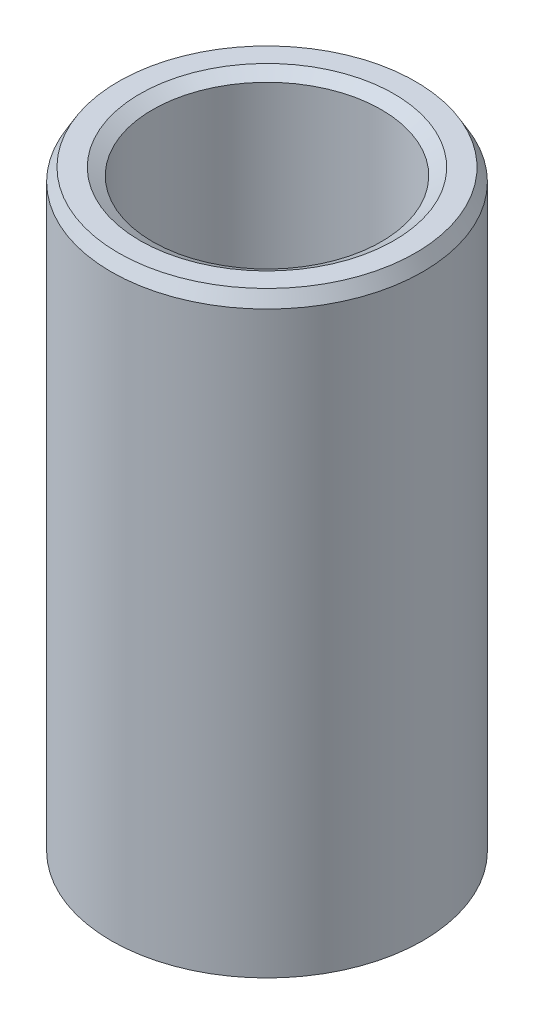
ISO-10303-21;
HEADER;
FILE_DESCRIPTION(('STEP AP214'),'2;1');
FILE_NAME('part.step','',(''),(''),'','','');
FILE_SCHEMA(('AUTOMOTIVE_DESIGN { 1 0 10303 214 1 1 1 1 }'));
ENDSEC;
DATA;
#1=APPLICATION_CONTEXT('core data for automotive mechanical design processes');
#2=APPLICATION_PROTOCOL_DEFINITION('international standard','automotive_design',2000,#1);
#3=PRODUCT_CONTEXT('',#1,'mechanical');
#4=PRODUCT('Part','Part','',(#3));
#5=PRODUCT_RELATED_PRODUCT_CATEGORY('part','',(#4));
#6=PRODUCT_DEFINITION_FORMATION('','',#4);
#7=PRODUCT_DEFINITION_CONTEXT('part definition',#1,'design');
#8=PRODUCT_DEFINITION('design','',#6,#7);
#9=PRODUCT_DEFINITION_SHAPE('','',#8);
#10=(LENGTH_UNIT() NAMED_UNIT(*) SI_UNIT(.MILLI.,.METRE.));
#11=(NAMED_UNIT(*) PLANE_ANGLE_UNIT() SI_UNIT($,.RADIAN.));
#12=(NAMED_UNIT(*) SI_UNIT($,.STERADIAN.) SOLID_ANGLE_UNIT());
#13=UNCERTAINTY_MEASURE_WITH_UNIT(LENGTH_MEASURE(1.E-05),#10,'distance_accuracy_value','');
#14=(GEOMETRIC_REPRESENTATION_CONTEXT(3) GLOBAL_UNCERTAINTY_ASSIGNED_CONTEXT((#13)) GLOBAL_UNIT_ASSIGNED_CONTEXT((#10,
#11,#12)) REPRESENTATION_CONTEXT('',''));
#15=CARTESIAN_POINT('',(0.,0.,0.));
#16=DIRECTION('',(0.,0.,1.));
#17=DIRECTION('',(1.,0.,0.));
#18=AXIS2_PLACEMENT_3D('',#15,#16,#17);
#19=CARTESIAN_POINT('',(0.,96.1271593765435,0.));
#20=DIRECTION('',(0.,-1.,0.));
#21=DIRECTION('',(0.,0.,-1.));
#22=AXIS2_PLACEMENT_3D('',#19,#20,#21);
#23=CYLINDRICAL_SURFACE('',#22,25.);
#24=CARTESIAN_POINT('',(0.,1.17416812610892,0.));
#25=DIRECTION('',(0.,1.,0.));
#26=DIRECTION('',(0.,0.,1.));
#27=AXIS2_PLACEMENT_3D('',#24,#25,#26);
#28=CIRCLE('',#27,25.);
#29=CARTESIAN_POINT('',(0.,1.17416812610892,25.));
#30=VERTEX_POINT('',#29);
#31=EDGE_CURVE('E10',#30,#30,#28,.T.);
#32=ORIENTED_EDGE('',*,*,#31,.T.);
#33=EDGE_LOOP('',(#32));
#34=FACE_BOUND('',#33,.T.);
#35=CARTESIAN_POINT('',(0.,94.0934405254949,0.));
#36=DIRECTION('',(0.,1.,0.));
#37=DIRECTION('',(0.,0.,1.));
#38=AXIS2_PLACEMENT_3D('',#35,#36,#37);
#39=CIRCLE('',#38,25.);
#40=CARTESIAN_POINT('',(0.,94.0934405254949,25.));
#41=VERTEX_POINT('',#40);
#42=EDGE_CURVE('E50',#41,#41,#39,.F.);
#43=ORIENTED_EDGE('',*,*,#42,.T.);
#44=EDGE_LOOP('',(#43));
#45=FACE_BOUND('',#44,.T.);
#46=ADVANCED_FACE('F39',(#34,#45),#23,.T.);
#47=CARTESIAN_POINT('',(0.,96.1271593765435,0.));
#48=DIRECTION('',(0.,1.,0.));
#49=DIRECTION('',(0.,0.,1.));
#50=AXIS2_PLACEMENT_3D('',#47,#48,#49);
#51=PLANE('',#50);
#52=CARTESIAN_POINT('',(0.,96.1271593765435,0.));
#53=DIRECTION('',(0.,1.,0.));
#54=DIRECTION('',(0.,0.,1.));
#55=AXIS2_PLACEMENT_3D('',#52,#53,#54);
#56=CIRCLE('',#55,20.3843804035312);
#57=CARTESIAN_POINT('',(0.,96.1271593765435,20.3843804035312));
#58=VERTEX_POINT('',#57);
#59=EDGE_CURVE('E58',#58,#58,#56,.F.);
#60=ORIENTED_EDGE('',*,*,#59,.T.);
#61=EDGE_LOOP('',(#60));
#62=FACE_BOUND('',#61,.T.);
#63=CARTESIAN_POINT('',(0.,96.1271593765435,0.));
#64=DIRECTION('',(0.,1.,0.));
#65=DIRECTION('',(0.,0.,1.));
#66=AXIS2_PLACEMENT_3D('',#63,#64,#65);
#67=CIRCLE('',#66,23.8258318738911);
#68=CARTESIAN_POINT('',(0.,96.1271593765435,23.8258318738911));
#69=VERTEX_POINT('',#68);
#70=EDGE_CURVE('E61',#69,#69,#67,.T.);
#71=ORIENTED_EDGE('',*,*,#70,.T.);
#72=EDGE_LOOP('',(#71));
#73=FACE_BOUND('',#72,.T.);
#74=ADVANCED_FACE('F88',(#62,#73),#51,.T.);
#75=CARTESIAN_POINT('',(0.,0.,0.));
#76=DIRECTION('',(0.,1.,0.));
#77=DIRECTION('',(0.,0.,1.));
#78=AXIS2_PLACEMENT_3D('',#75,#76,#77);
#79=PLANE('',#78);
#80=CARTESIAN_POINT('',(0.,0.,0.));
#81=DIRECTION('',(0.,1.,0.));
#82=DIRECTION('',(0.,0.,1.));
#83=AXIS2_PLACEMENT_3D('',#80,#81,#82);
#84=CIRCLE('',#83,19.5248296785915);
#85=CARTESIAN_POINT('',(0.,0.,19.5248296785915));
#86=VERTEX_POINT('',#85);
#87=EDGE_CURVE('E51',#86,#86,#84,.T.);
#88=ORIENTED_EDGE('',*,*,#87,.T.);
#89=EDGE_LOOP('',(#88));
#90=FACE_BOUND('',#89,.T.);
#91=CARTESIAN_POINT('',(0.,0.,0.));
#92=DIRECTION('',(0.,1.,0.));
#93=DIRECTION('',(0.,0.,1.));
#94=AXIS2_PLACEMENT_3D('',#91,#92,#93);
#95=CIRCLE('',#94,22.9662811489514);
#96=CARTESIAN_POINT('',(0.,0.,22.9662811489514));
#97=VERTEX_POINT('',#96);
#98=EDGE_CURVE('E54',#97,#97,#95,.F.);
#99=ORIENTED_EDGE('',*,*,#98,.T.);
#100=EDGE_LOOP('',(#99));
#101=FACE_BOUND('',#100,.T.);
#102=ADVANCED_FACE('F83',(#90,#101),#79,.F.);
#103=CARTESIAN_POINT('',(0.,96.1271593765435,0.));
#104=DIRECTION('',(0.,-1.,0.));
#105=DIRECTION('',(0.,0.,-1.));
#106=AXIS2_PLACEMENT_3D('',#103,#104,#105);
#107=CYLINDRICAL_SURFACE('',#106,18.3506615524826);
#108=CARTESIAN_POINT('',(0.,94.9529912504346,0.));
#109=DIRECTION('',(0.,1.,0.));
#110=DIRECTION('',(0.,0.,1.));
#111=AXIS2_PLACEMENT_3D('',#108,#109,#110);
#112=CIRCLE('',#111,18.3506615524826);
#113=CARTESIAN_POINT('',(0.,94.9529912504346,18.3506615524826));
#114=VERTEX_POINT('',#113);
#115=EDGE_CURVE('E67',#114,#114,#112,.T.);
#116=ORIENTED_EDGE('',*,*,#115,.T.);
#117=EDGE_LOOP('',(#116));
#118=FACE_BOUND('',#117,.T.);
#119=CARTESIAN_POINT('',(0.,2.03371885104861,0.));
#120=DIRECTION('',(0.,1.,0.));
#121=DIRECTION('',(0.,0.,1.));
#122=AXIS2_PLACEMENT_3D('',#119,#120,#121);
#123=CIRCLE('',#122,18.3506615524826);
#124=CARTESIAN_POINT('',(0.,2.03371885104861,18.3506615524826));
#125=VERTEX_POINT('',#124);
#126=EDGE_CURVE('E69',#125,#125,#123,.F.);
#127=ORIENTED_EDGE('',*,*,#126,.T.);
#128=EDGE_LOOP('',(#127));
#129=FACE_BOUND('',#128,.T.);
#130=ADVANCED_FACE('F71',(#118,#129),#107,.F.);
#131=CARTESIAN_POINT('',(0.,94.9529912504346,0.));
#132=DIRECTION('',(0.,1.,0.));
#133=DIRECTION('',(0.,0.,1.));
#134=AXIS2_PLACEMENT_3D('',#131,#132,#133);
#135=CONICAL_SURFACE('',#134,18.3506615524826,1.0471975511966);
#136=ORIENTED_EDGE('',*,*,#59,.F.);
#137=EDGE_LOOP('',(#136));
#138=FACE_BOUND('',#137,.T.);
#139=ORIENTED_EDGE('',*,*,#115,.F.);
#140=EDGE_LOOP('',(#139));
#141=FACE_BOUND('',#140,.T.);
#142=ADVANCED_FACE('F77',(#138,#141),#135,.F.);
#143=CARTESIAN_POINT('',(0.,0.,0.));
#144=DIRECTION('',(0.,-1.,0.));
#145=DIRECTION('',(0.,0.,-1.));
#146=AXIS2_PLACEMENT_3D('',#143,#144,#145);
#147=CONICAL_SURFACE('',#146,19.5248296785915,0.523598775598295);
#148=ORIENTED_EDGE('',*,*,#126,.F.);
#149=EDGE_LOOP('',(#148));
#150=FACE_BOUND('',#149,.T.);
#151=ORIENTED_EDGE('',*,*,#87,.F.);
#152=EDGE_LOOP('',(#151));
#153=FACE_BOUND('',#152,.T.);
#154=ADVANCED_FACE('F73',(#150,#153),#147,.F.);
#155=CARTESIAN_POINT('',(0.,1.17416812610892,0.));
#156=DIRECTION('',(0.,1.,0.));
#157=DIRECTION('',(0.,0.,1.));
#158=AXIS2_PLACEMENT_3D('',#155,#156,#157);
#159=CONICAL_SURFACE('',#158,25.,1.0471975511966);
#160=ORIENTED_EDGE('',*,*,#98,.F.);
#161=EDGE_LOOP('',(#160));
#162=FACE_BOUND('',#161,.T.);
#163=ORIENTED_EDGE('',*,*,#31,.F.);
#164=EDGE_LOOP('',(#163));
#165=FACE_BOUND('',#164,.T.);
#166=ADVANCED_FACE('F76',(#162,#165),#159,.T.);
#167=CARTESIAN_POINT('',(0.,96.1271593765435,0.));
#168=DIRECTION('',(0.,-1.,0.));
#169=DIRECTION('',(0.,0.,-1.));
#170=AXIS2_PLACEMENT_3D('',#167,#168,#169);
#171=CONICAL_SURFACE('',#170,23.8258318738911,0.523598775598296);
#172=ORIENTED_EDGE('',*,*,#42,.F.);
#173=EDGE_LOOP('',(#172));
#174=FACE_BOUND('',#173,.T.);
#175=ORIENTED_EDGE('',*,*,#70,.F.);
#176=EDGE_LOOP('',(#175));
#177=FACE_BOUND('',#176,.T.);
#178=ADVANCED_FACE('F45',(#174,#177),#171,.T.);
#179=CLOSED_SHELL('',(#46,#74,#102,#130,#142,#154,#166,#178));
#180=MANIFOLD_SOLID_BREP('B2',#179);
#181=ADVANCED_BREP_SHAPE_REPRESENTATION('',(#18,#180),#14);
#182=SHAPE_DEFINITION_REPRESENTATION(#9,#181);
ENDSEC;
END-ISO-10303-21;
